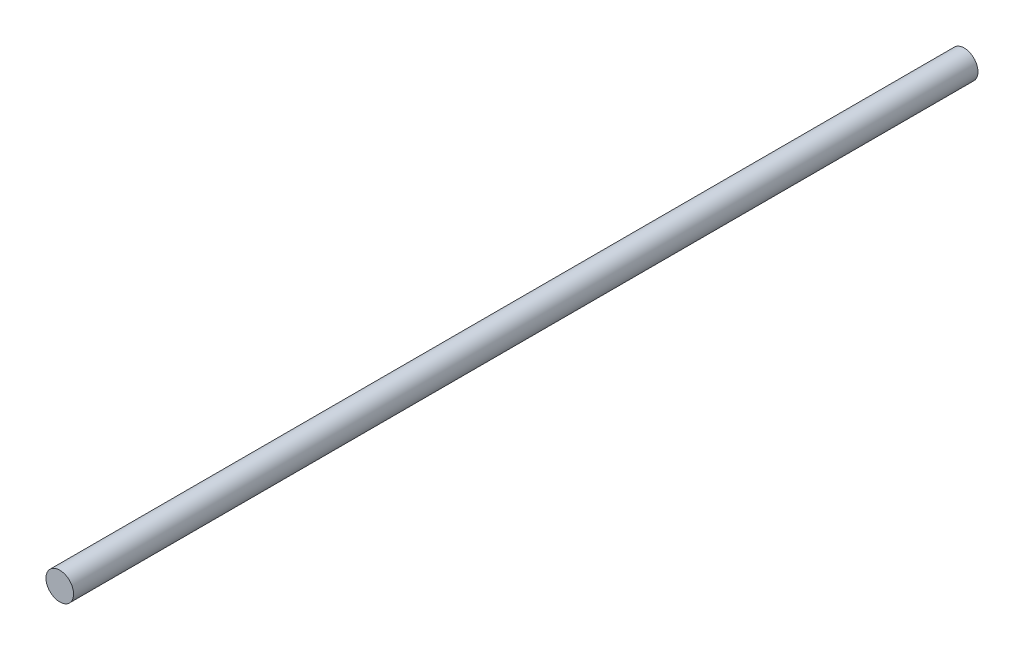
ISO-10303-21;
HEADER;
FILE_DESCRIPTION(('STEP AP214'),'2;1');
FILE_NAME('part.step','',(''),(''),'','','');
FILE_SCHEMA(('AUTOMOTIVE_DESIGN { 1 0 10303 214 1 1 1 1 }'));
ENDSEC;
DATA;
#1=APPLICATION_CONTEXT('core data for automotive mechanical design processes');
#2=APPLICATION_PROTOCOL_DEFINITION('international standard','automotive_design',2000,#1);
#3=PRODUCT_CONTEXT('',#1,'mechanical');
#4=PRODUCT('Part','Part','',(#3));
#5=PRODUCT_RELATED_PRODUCT_CATEGORY('part','',(#4));
#6=PRODUCT_DEFINITION_FORMATION('','',#4);
#7=PRODUCT_DEFINITION_CONTEXT('part definition',#1,'design');
#8=PRODUCT_DEFINITION('design','',#6,#7);
#9=PRODUCT_DEFINITION_SHAPE('','',#8);
#10=(LENGTH_UNIT() NAMED_UNIT(*) SI_UNIT(.MILLI.,.METRE.));
#11=(NAMED_UNIT(*) PLANE_ANGLE_UNIT() SI_UNIT($,.RADIAN.));
#12=(NAMED_UNIT(*) SI_UNIT($,.STERADIAN.) SOLID_ANGLE_UNIT());
#13=UNCERTAINTY_MEASURE_WITH_UNIT(LENGTH_MEASURE(1.E-05),#10,'distance_accuracy_value','');
#14=(GEOMETRIC_REPRESENTATION_CONTEXT(3) GLOBAL_UNCERTAINTY_ASSIGNED_CONTEXT((#13)) GLOBAL_UNIT_ASSIGNED_CONTEXT((#10,
#11,#12)) REPRESENTATION_CONTEXT('',''));
#15=CARTESIAN_POINT('',(0.,0.,0.));
#16=DIRECTION('',(0.,0.,1.));
#17=DIRECTION('',(1.,0.,0.));
#18=AXIS2_PLACEMENT_3D('',#15,#16,#17);
#19=CARTESIAN_POINT('',(0.,0.,328.));
#20=DIRECTION('',(0.,0.,-1.));
#21=DIRECTION('',(-1.,0.,0.));
#22=AXIS2_PLACEMENT_3D('',#19,#20,#21);
#23=CYLINDRICAL_SURFACE('',#22,5.);
#24=CARTESIAN_POINT('',(0.,0.,328.));
#25=DIRECTION('',(0.,0.,1.));
#26=DIRECTION('',(1.,0.,0.));
#27=AXIS2_PLACEMENT_3D('',#24,#25,#26);
#28=CIRCLE('',#27,5.);
#29=CARTESIAN_POINT('',(5.,0.,328.));
#30=VERTEX_POINT('',#29);
#31=EDGE_CURVE('E10',#30,#30,#28,.T.);
#32=ORIENTED_EDGE('',*,*,#31,.F.);
#33=EDGE_LOOP('',(#32));
#34=FACE_BOUND('',#33,.T.);
#35=CARTESIAN_POINT('',(0.,0.,0.));
#36=DIRECTION('',(0.,0.,1.));
#37=DIRECTION('',(1.,0.,0.));
#38=AXIS2_PLACEMENT_3D('',#35,#36,#37);
#39=CIRCLE('',#38,5.);
#40=CARTESIAN_POINT('',(5.,0.,0.));
#41=VERTEX_POINT('',#40);
#42=EDGE_CURVE('E32',#41,#41,#39,.T.);
#43=ORIENTED_EDGE('',*,*,#42,.T.);
#44=EDGE_LOOP('',(#43));
#45=FACE_BOUND('',#44,.T.);
#46=ADVANCED_FACE('F29',(#34,#45),#23,.T.);
#47=CARTESIAN_POINT('',(0.,0.,328.));
#48=DIRECTION('',(0.,0.,1.));
#49=DIRECTION('',(1.,0.,0.));
#50=AXIS2_PLACEMENT_3D('',#47,#48,#49);
#51=PLANE('',#50);
#52=ORIENTED_EDGE('',*,*,#31,.T.);
#53=EDGE_LOOP('',(#52));
#54=FACE_BOUND('',#53,.T.);
#55=ADVANCED_FACE('F44',(#54),#51,.T.);
#56=CARTESIAN_POINT('',(0.,0.,0.));
#57=DIRECTION('',(0.,0.,1.));
#58=DIRECTION('',(1.,0.,0.));
#59=AXIS2_PLACEMENT_3D('',#56,#57,#58);
#60=PLANE('',#59);
#61=ORIENTED_EDGE('',*,*,#42,.F.);
#62=EDGE_LOOP('',(#61));
#63=FACE_BOUND('',#62,.T.);
#64=ADVANCED_FACE('F42',(#63),#60,.F.);
#65=CLOSED_SHELL('',(#46,#55,#64));
#66=MANIFOLD_SOLID_BREP('B2',#65);
#67=ADVANCED_BREP_SHAPE_REPRESENTATION('',(#18,#66),#14);
#68=SHAPE_DEFINITION_REPRESENTATION(#9,#67);
ENDSEC;
END-ISO-10303-21;
